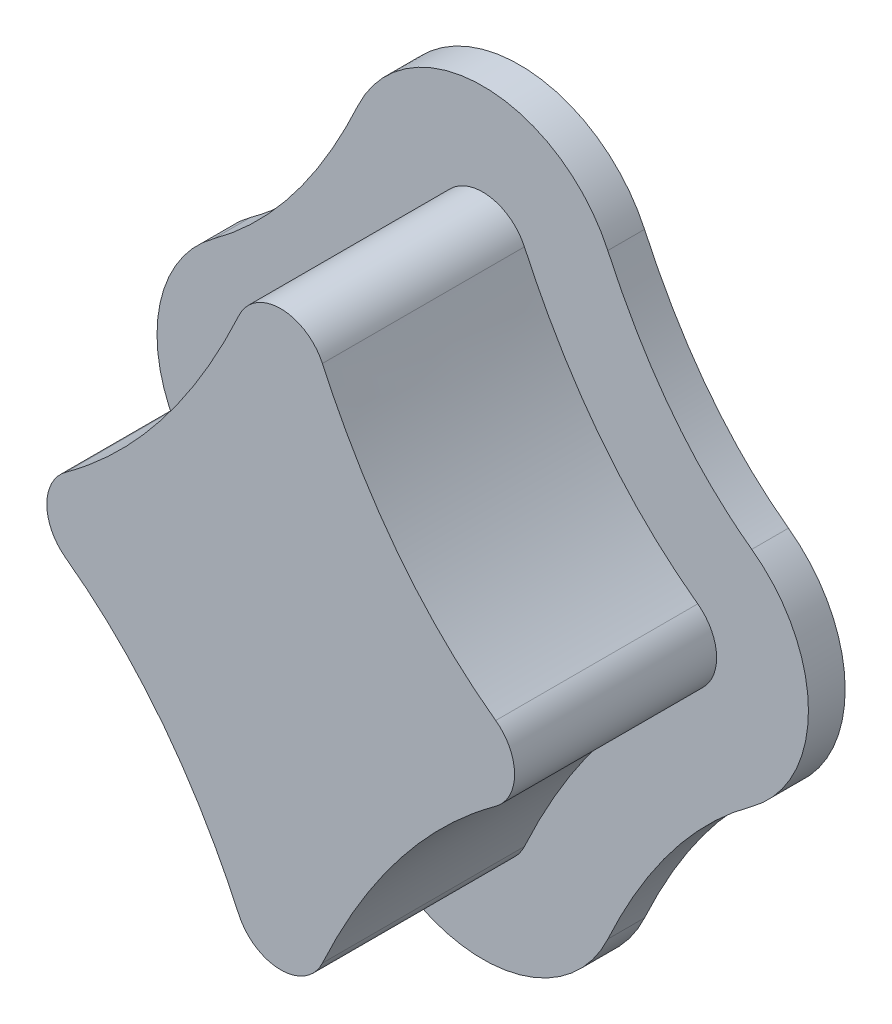
ISO-10303-21;
HEADER;
FILE_DESCRIPTION(('STEP AP214'),'2;1');
FILE_NAME('part.step','',(''),(''),'','','');
FILE_SCHEMA(('AUTOMOTIVE_DESIGN { 1 0 10303 214 1 1 1 1 }'));
ENDSEC;
DATA;
#1=APPLICATION_CONTEXT('core data for automotive mechanical design processes');
#2=APPLICATION_PROTOCOL_DEFINITION('international standard','automotive_design',2000,#1);
#3=PRODUCT_CONTEXT('',#1,'mechanical');
#4=PRODUCT('Part','Part','',(#3));
#5=PRODUCT_RELATED_PRODUCT_CATEGORY('part','',(#4));
#6=PRODUCT_DEFINITION_FORMATION('','',#4);
#7=PRODUCT_DEFINITION_CONTEXT('part definition',#1,'design');
#8=PRODUCT_DEFINITION('design','',#6,#7);
#9=PRODUCT_DEFINITION_SHAPE('','',#8);
#10=(LENGTH_UNIT() NAMED_UNIT(*) SI_UNIT(.MILLI.,.METRE.));
#11=(NAMED_UNIT(*) PLANE_ANGLE_UNIT() SI_UNIT($,.RADIAN.));
#12=(NAMED_UNIT(*) SI_UNIT($,.STERADIAN.) SOLID_ANGLE_UNIT());
#13=UNCERTAINTY_MEASURE_WITH_UNIT(LENGTH_MEASURE(1.E-05),#10,'distance_accuracy_value','');
#14=(GEOMETRIC_REPRESENTATION_CONTEXT(3) GLOBAL_UNCERTAINTY_ASSIGNED_CONTEXT((#13)) GLOBAL_UNIT_ASSIGNED_CONTEXT((#10,
#11,#12)) REPRESENTATION_CONTEXT('',''));
#15=CARTESIAN_POINT('',(0.,0.,0.));
#16=DIRECTION('',(0.,0.,1.));
#17=DIRECTION('',(1.,0.,0.));
#18=AXIS2_PLACEMENT_3D('',#15,#16,#17);
#19=CARTESIAN_POINT('',(0.,4.,2.6));
#20=CARTESIAN_POINT('',(-0.515028323958236,2.41490580617474,2.6));
#21=CARTESIAN_POINT('',(-1.36313106985769,0.834026377394227,2.6));
#22=CARTESIAN_POINT('',(-3.,0.,2.6));
#23=B_SPLINE_CURVE_WITH_KNOTS('',3,(#19,#20,#21,#22),.UNSPECIFIED.,.F.,.F.,(4,4),(0.,1.),.UNSPECIFIED.);
#24=DIRECTION('',(0.,0.,-1.));
#25=VECTOR('',#24,1.);
#26=SURFACE_OF_LINEAR_EXTRUSION('',#23,#25);
#27=DIRECTION('',(0.,0.,-1.));
#28=VECTOR('',#27,1.);
#29=CARTESIAN_POINT('',(-0.453987770861221,2.82759052216647,2.6));
#30=LINE('',#29,#28);
#31=CARTESIAN_POINT('',(-0.453987770861657,2.82759052216552,2.6));
#32=VERTEX_POINT('',#31);
#33=CARTESIAN_POINT('',(-0.453987770861221,2.82759052216647,0.4));
#34=VERTEX_POINT('',#33);
#35=EDGE_CURVE('E532',#32,#34,#30,.T.);
#36=ORIENTED_EDGE('',*,*,#35,.T.);
#37=CARTESIAN_POINT('',(0.,4.,0.4));
#38=CARTESIAN_POINT('',(-0.515028323958236,2.41490580617474,0.4));
#39=CARTESIAN_POINT('',(-1.36313106985769,0.834026377394227,0.4));
#40=CARTESIAN_POINT('',(-3.,0.,0.4));
#41=B_SPLINE_CURVE_WITH_KNOTS('',3,(#37,#38,#39,#40),.UNSPECIFIED.,.F.,.F.,(4,4),(0.,1.),.UNSPECIFIED.);
#42=CARTESIAN_POINT('',(-2.34106813028707,0.404186248686506,0.4));
#43=VERTEX_POINT('',#42);
#44=EDGE_CURVE('E183',#34,#43,#41,.T.);
#45=ORIENTED_EDGE('',*,*,#44,.T.);
#46=DIRECTION('',(0.,0.,-1.));
#47=VECTOR('',#46,1.);
#48=CARTESIAN_POINT('',(-2.34106813028707,0.404186248686506,0.));
#49=LINE('',#48,#47);
#50=CARTESIAN_POINT('',(-2.34106813028708,0.404186248686506,2.6));
#51=VERTEX_POINT('',#50);
#52=EDGE_CURVE('E530',#43,#51,#49,.F.);
#53=ORIENTED_EDGE('',*,*,#52,.T.);
#54=EDGE_CURVE('E457',#32,#51,#23,.T.);
#55=ORIENTED_EDGE('',*,*,#54,.F.);
#56=EDGE_LOOP('',(#36,#45,#53,#55));
#57=FACE_BOUND('',#56,.T.);
#58=ADVANCED_FACE('F32',(#57),#26,.F.);
#59=CARTESIAN_POINT('',(-3.,0.,2.6));
#60=CARTESIAN_POINT('',(-1.36313106985769,-0.834026377394228,2.6));
#61=CARTESIAN_POINT('',(-0.515028323958237,-2.41490580617474,2.6));
#62=CARTESIAN_POINT('',(0.,-4.,2.6));
#63=B_SPLINE_CURVE_WITH_KNOTS('',3,(#59,#60,#61,#62),.UNSPECIFIED.,.F.,.F.,(4,4),(0.,1.),.UNSPECIFIED.);
#64=DIRECTION('',(0.,0.,-1.));
#65=VECTOR('',#64,1.);
#66=SURFACE_OF_LINEAR_EXTRUSION('',#63,#65);
#67=DIRECTION('',(0.,0.,-1.));
#68=VECTOR('',#67,1.);
#69=CARTESIAN_POINT('',(-2.34106813028707,-0.404186248686511,2.6));
#70=LINE('',#69,#68);
#71=CARTESIAN_POINT('',(-2.34106813028707,-0.404186248686511,2.6));
#72=VERTEX_POINT('',#71);
#73=CARTESIAN_POINT('',(-2.34106813028707,-0.404186248686511,0.4));
#74=VERTEX_POINT('',#73);
#75=EDGE_CURVE('E501',#72,#74,#70,.T.);
#76=ORIENTED_EDGE('',*,*,#75,.T.);
#77=CARTESIAN_POINT('',(-3.,0.,0.4));
#78=CARTESIAN_POINT('',(-1.36313106985769,-0.834026377394228,0.4));
#79=CARTESIAN_POINT('',(-0.515028323958237,-2.41490580617474,0.4));
#80=CARTESIAN_POINT('',(0.,-4.,0.4));
#81=B_SPLINE_CURVE_WITH_KNOTS('',3,(#77,#78,#79,#80),.UNSPECIFIED.,.F.,.F.,(4,4),(0.,1.),.UNSPECIFIED.);
#82=CARTESIAN_POINT('',(-0.453987770861221,-2.82759052216647,0.4));
#83=VERTEX_POINT('',#82);
#84=EDGE_CURVE('E59',#74,#83,#81,.T.);
#85=ORIENTED_EDGE('',*,*,#84,.T.);
#86=DIRECTION('',(0.,0.,-1.));
#87=VECTOR('',#86,1.);
#88=CARTESIAN_POINT('',(-0.453987770861221,-2.82759052216647,0.));
#89=LINE('',#88,#87);
#90=CARTESIAN_POINT('',(-0.453987770861658,-2.82759052216552,2.6));
#91=VERTEX_POINT('',#90);
#92=EDGE_CURVE('E557',#83,#91,#89,.F.);
#93=ORIENTED_EDGE('',*,*,#92,.T.);
#94=EDGE_CURVE('E463',#72,#91,#63,.T.);
#95=ORIENTED_EDGE('',*,*,#94,.F.);
#96=EDGE_LOOP('',(#76,#85,#93,#95));
#97=FACE_BOUND('',#96,.T.);
#98=ADVANCED_FACE('F443',(#97),#66,.F.);
#99=CARTESIAN_POINT('',(0.,-4.,2.6));
#100=CARTESIAN_POINT('',(0.515028323958236,-2.41490580617474,2.6));
#101=CARTESIAN_POINT('',(1.36313106985769,-0.834026377394228,2.6));
#102=CARTESIAN_POINT('',(3.,0.,2.6));
#103=B_SPLINE_CURVE_WITH_KNOTS('',3,(#99,#100,#101,#102),.UNSPECIFIED.,.F.,.F.,(4,4),(0.,1.),.UNSPECIFIED.);
#104=DIRECTION('',(0.,0.,-1.));
#105=VECTOR('',#104,1.);
#106=SURFACE_OF_LINEAR_EXTRUSION('',#103,#105);
#107=DIRECTION('',(0.,0.,-1.));
#108=VECTOR('',#107,1.);
#109=CARTESIAN_POINT('',(0.453987770861221,-2.82759052216647,2.6));
#110=LINE('',#109,#108);
#111=CARTESIAN_POINT('',(0.453987770861657,-2.82759052216552,2.6));
#112=VERTEX_POINT('',#111);
#113=CARTESIAN_POINT('',(0.453987770861221,-2.82759052216647,0.4));
#114=VERTEX_POINT('',#113);
#115=EDGE_CURVE('E496',#112,#114,#110,.T.);
#116=ORIENTED_EDGE('',*,*,#115,.T.);
#117=CARTESIAN_POINT('',(0.,-4.,0.4));
#118=CARTESIAN_POINT('',(0.515028323958236,-2.41490580617474,0.4));
#119=CARTESIAN_POINT('',(1.36313106985769,-0.834026377394228,0.4));
#120=CARTESIAN_POINT('',(3.,0.,0.4));
#121=B_SPLINE_CURVE_WITH_KNOTS('',3,(#117,#118,#119,#120),.UNSPECIFIED.,.F.,.F.,(4,4),(0.,1.),.UNSPECIFIED.);
#122=CARTESIAN_POINT('',(2.34106813028708,-0.404186248686507,0.4));
#123=VERTEX_POINT('',#122);
#124=EDGE_CURVE('E498',#114,#123,#121,.T.);
#125=ORIENTED_EDGE('',*,*,#124,.T.);
#126=DIRECTION('',(0.,0.,-1.));
#127=VECTOR('',#126,1.);
#128=CARTESIAN_POINT('',(2.34106813028708,-0.404186248686507,0.));
#129=LINE('',#128,#127);
#130=CARTESIAN_POINT('',(2.34106813028708,-0.404186248686507,2.6));
#131=VERTEX_POINT('',#130);
#132=EDGE_CURVE('E502',#123,#131,#129,.F.);
#133=ORIENTED_EDGE('',*,*,#132,.T.);
#134=EDGE_CURVE('E473',#112,#131,#103,.T.);
#135=ORIENTED_EDGE('',*,*,#134,.F.);
#136=EDGE_LOOP('',(#116,#125,#133,#135));
#137=FACE_BOUND('',#136,.T.);
#138=ADVANCED_FACE('F449',(#137),#106,.F.);
#139=CARTESIAN_POINT('',(3.,0.,2.6));
#140=CARTESIAN_POINT('',(1.36313106985769,0.834026377394227,2.6));
#141=CARTESIAN_POINT('',(0.515028323958237,2.41490580617474,2.6));
#142=CARTESIAN_POINT('',(0.,4.,2.6));
#143=B_SPLINE_CURVE_WITH_KNOTS('',3,(#139,#140,#141,#142),.UNSPECIFIED.,.F.,.F.,(4,4),(0.,1.),.UNSPECIFIED.);
#144=DIRECTION('',(0.,0.,-1.));
#145=VECTOR('',#144,1.);
#146=SURFACE_OF_LINEAR_EXTRUSION('',#143,#145);
#147=DIRECTION('',(0.,0.,-1.));
#148=VECTOR('',#147,1.);
#149=CARTESIAN_POINT('',(2.34106813028707,0.40418624868651,2.6));
#150=LINE('',#149,#148);
#151=CARTESIAN_POINT('',(2.34106813028707,0.40418624868651,2.6));
#152=VERTEX_POINT('',#151);
#153=CARTESIAN_POINT('',(2.34106813028707,0.40418624868651,0.4));
#154=VERTEX_POINT('',#153);
#155=EDGE_CURVE('E43',#152,#154,#150,.T.);
#156=ORIENTED_EDGE('',*,*,#155,.T.);
#157=CARTESIAN_POINT('',(3.,0.,0.4));
#158=CARTESIAN_POINT('',(1.36313106985769,0.834026377394227,0.4));
#159=CARTESIAN_POINT('',(0.515028323958237,2.41490580617474,0.4));
#160=CARTESIAN_POINT('',(0.,4.,0.4));
#161=B_SPLINE_CURVE_WITH_KNOTS('',3,(#157,#158,#159,#160),.UNSPECIFIED.,.F.,.F.,(4,4),(0.,1.),.UNSPECIFIED.);
#162=CARTESIAN_POINT('',(0.453987770861657,2.82759052216553,0.4));
#163=VERTEX_POINT('',#162);
#164=EDGE_CURVE('E180',#154,#163,#161,.T.);
#165=ORIENTED_EDGE('',*,*,#164,.T.);
#166=DIRECTION('',(0.,0.,-1.));
#167=VECTOR('',#166,1.);
#168=CARTESIAN_POINT('',(0.453987770861221,2.82759052216647,0.));
#169=LINE('',#168,#167);
#170=CARTESIAN_POINT('',(0.453987770861657,2.82759052216553,2.6));
#171=VERTEX_POINT('',#170);
#172=EDGE_CURVE('E538',#163,#171,#169,.F.);
#173=ORIENTED_EDGE('',*,*,#172,.T.);
#174=EDGE_CURVE('E481',#152,#171,#143,.T.);
#175=ORIENTED_EDGE('',*,*,#174,.F.);
#176=EDGE_LOOP('',(#156,#165,#173,#175));
#177=FACE_BOUND('',#176,.T.);
#178=ADVANCED_FACE('F396',(#177),#146,.F.);
#179=CARTESIAN_POINT('',(-1.07930977268097,1.71834956883836,2.6));
#180=DIRECTION('',(0.,0.,1.));
#181=DIRECTION('',(1.,0.,0.));
#182=AXIS2_PLACEMENT_3D('',#179,#180,#181);
#183=PLANE('',#182);
#184=ORIENTED_EDGE('',*,*,#94,.T.);
#185=CARTESIAN_POINT('',(0.,-2.61807893797968,2.6));
#186=DIRECTION('',(0.,0.,1.));
#187=DIRECTION('',(1.,0.,0.));
#188=AXIS2_PLACEMENT_3D('',#185,#186,#187);
#189=CIRCLE('',#188,0.5);
#190=EDGE_CURVE('E541',#91,#112,#189,.T.);
#191=ORIENTED_EDGE('',*,*,#190,.T.);
#192=ORIENTED_EDGE('',*,*,#134,.T.);
#193=CARTESIAN_POINT('',(2.0467324777189,0.,2.6));
#194=DIRECTION('',(0.,0.,1.));
#195=DIRECTION('',(1.,0.,0.));
#196=AXIS2_PLACEMENT_3D('',#193,#194,#195);
#197=CIRCLE('',#196,0.5);
#198=EDGE_CURVE('E554',#131,#152,#197,.T.);
#199=ORIENTED_EDGE('',*,*,#198,.T.);
#200=ORIENTED_EDGE('',*,*,#174,.T.);
#201=CARTESIAN_POINT('',(0.,2.61807893797968,2.6));
#202=DIRECTION('',(0.,0.,1.));
#203=DIRECTION('',(1.,0.,0.));
#204=AXIS2_PLACEMENT_3D('',#201,#202,#203);
#205=CIRCLE('',#204,0.5);
#206=EDGE_CURVE('E552',#171,#32,#205,.T.);
#207=ORIENTED_EDGE('',*,*,#206,.T.);
#208=ORIENTED_EDGE('',*,*,#54,.T.);
#209=CARTESIAN_POINT('',(-2.0467324777189,0.,2.6));
#210=DIRECTION('',(0.,0.,1.));
#211=DIRECTION('',(1.,0.,0.));
#212=AXIS2_PLACEMENT_3D('',#209,#210,#211);
#213=CIRCLE('',#212,0.5);
#214=EDGE_CURVE('E537',#51,#72,#213,.T.);
#215=ORIENTED_EDGE('',*,*,#214,.T.);
#216=EDGE_LOOP('',(#184,#191,#192,#199,#200,#207,#208,#215));
#217=FACE_BOUND('',#216,.T.);
#218=ADVANCED_FACE('F210',(#217),#183,.T.);
#219=CARTESIAN_POINT('',(0.,-2.61807893797968,1.3));
#220=DIRECTION('',(0.,0.,-1.));
#221=DIRECTION('',(-1.,0.,0.));
#222=AXIS2_PLACEMENT_3D('',#219,#220,#221);
#223=CYLINDRICAL_SURFACE('',#222,0.5);
#224=CARTESIAN_POINT('',(0.,-2.61807893797968,0.4));
#225=DIRECTION('',(0.,0.,1.));
#226=DIRECTION('',(1.,0.,0.));
#227=AXIS2_PLACEMENT_3D('',#224,#225,#226);
#228=CIRCLE('',#227,0.5);
#229=EDGE_CURVE('E51',#114,#83,#228,.F.);
#230=ORIENTED_EDGE('',*,*,#229,.F.);
#231=ORIENTED_EDGE('',*,*,#115,.F.);
#232=ORIENTED_EDGE('',*,*,#190,.F.);
#233=ORIENTED_EDGE('',*,*,#92,.F.);
#234=EDGE_LOOP('',(#230,#231,#232,#233));
#235=FACE_BOUND('',#234,.T.);
#236=ADVANCED_FACE('F455',(#235),#223,.T.);
#237=CARTESIAN_POINT('',(-2.0467324777189,0.,1.3));
#238=DIRECTION('',(0.,0.,-1.));
#239=DIRECTION('',(-1.,0.,0.));
#240=AXIS2_PLACEMENT_3D('',#237,#238,#239);
#241=CYLINDRICAL_SURFACE('',#240,0.5);
#242=CARTESIAN_POINT('',(-2.0467324777189,0.,0.4));
#243=DIRECTION('',(0.,0.,1.));
#244=DIRECTION('',(1.,0.,0.));
#245=AXIS2_PLACEMENT_3D('',#242,#243,#244);
#246=CIRCLE('',#245,0.5);
#247=EDGE_CURVE('E507',#74,#43,#246,.F.);
#248=ORIENTED_EDGE('',*,*,#247,.F.);
#249=ORIENTED_EDGE('',*,*,#75,.F.);
#250=ORIENTED_EDGE('',*,*,#214,.F.);
#251=ORIENTED_EDGE('',*,*,#52,.F.);
#252=EDGE_LOOP('',(#248,#249,#250,#251));
#253=FACE_BOUND('',#252,.T.);
#254=ADVANCED_FACE('F535',(#253),#241,.T.);
#255=CARTESIAN_POINT('',(2.0467324777189,0.,1.3));
#256=DIRECTION('',(0.,0.,-1.));
#257=DIRECTION('',(-1.,0.,0.));
#258=AXIS2_PLACEMENT_3D('',#255,#256,#257);
#259=CYLINDRICAL_SURFACE('',#258,0.5);
#260=CARTESIAN_POINT('',(2.0467324777189,0.,0.4));
#261=DIRECTION('',(0.,0.,1.));
#262=DIRECTION('',(1.,0.,0.));
#263=AXIS2_PLACEMENT_3D('',#260,#261,#262);
#264=CIRCLE('',#263,0.5);
#265=EDGE_CURVE('E506',#154,#123,#264,.F.);
#266=ORIENTED_EDGE('',*,*,#265,.F.);
#267=ORIENTED_EDGE('',*,*,#155,.F.);
#268=ORIENTED_EDGE('',*,*,#198,.F.);
#269=ORIENTED_EDGE('',*,*,#132,.F.);
#270=EDGE_LOOP('',(#266,#267,#268,#269));
#271=FACE_BOUND('',#270,.T.);
#272=ADVANCED_FACE('F567',(#271),#259,.T.);
#273=CARTESIAN_POINT('',(0.,2.61807893797968,1.3));
#274=DIRECTION('',(0.,0.,-1.));
#275=DIRECTION('',(-1.,0.,0.));
#276=AXIS2_PLACEMENT_3D('',#273,#274,#275);
#277=CYLINDRICAL_SURFACE('',#276,0.5);
#278=CARTESIAN_POINT('',(0.,2.61807893797968,0.4));
#279=DIRECTION('',(0.,0.,1.));
#280=DIRECTION('',(1.,0.,0.));
#281=AXIS2_PLACEMENT_3D('',#278,#279,#280);
#282=CIRCLE('',#281,0.5);
#283=EDGE_CURVE('E11',#34,#163,#282,.F.);
#284=ORIENTED_EDGE('',*,*,#283,.F.);
#285=ORIENTED_EDGE('',*,*,#35,.F.);
#286=ORIENTED_EDGE('',*,*,#206,.F.);
#287=ORIENTED_EDGE('',*,*,#172,.F.);
#288=EDGE_LOOP('',(#284,#285,#286,#287));
#289=FACE_BOUND('',#288,.T.);
#290=ADVANCED_FACE('F34',(#289),#277,.T.);
#291=CARTESIAN_POINT('',(-1.36196331258444,3.24661369053838,0.4));
#292=CARTESIAN_POINT('',(-1.54359804863867,2.85303187857204,0.4));
#293=CARTESIAN_POINT('',(-1.75763553928025,2.47411694981708,0.4));
#294=CARTESIAN_POINT('',(-2.27478193280841,1.78099121797967,0.4));
#295=CARTESIAN_POINT('',(-2.57878831480917,1.46812762659717,0.4));
#296=CARTESIAN_POINT('',(-2.92973943542342,1.21255874605952,0.4));
#297=B_SPLINE_CURVE_WITH_KNOTS('',3,(#291,#292,#293,#294,#295,#296),.UNSPECIFIED.,.F.,.F.,(4,2,
4),(0.,0.5,1.),.UNSPECIFIED.);
#298=DIRECTION('',(0.,0.,-1.));
#299=VECTOR('',#298,1.);
#300=SURFACE_OF_LINEAR_EXTRUSION('',#297,#299);
#301=CARTESIAN_POINT('',(-1.36196331258444,3.24661369053838,0.));
#302=CARTESIAN_POINT('',(-1.54359804863867,2.85303187857204,0.));
#303=CARTESIAN_POINT('',(-1.75763553928025,2.47411694981708,0.));
#304=CARTESIAN_POINT('',(-2.27478193280841,1.78099121797967,0.));
#305=CARTESIAN_POINT('',(-2.57878831480917,1.46812762659717,0.));
#306=CARTESIAN_POINT('',(-2.92973943542342,1.21255874605952,0.));
#307=B_SPLINE_CURVE_WITH_KNOTS('',3,(#301,#302,#303,#304,#305,#306),.UNSPECIFIED.,.F.,.F.,(4,2,
4),(0.,0.5,1.),.UNSPECIFIED.);
#308=CARTESIAN_POINT('',(-1.36196331258444,3.24661369053838,0.));
#309=VERTEX_POINT('',#308);
#310=CARTESIAN_POINT('',(-2.92973943542341,1.21255874605951,0.));
#311=VERTEX_POINT('',#310);
#312=EDGE_CURVE('E178',#309,#311,#307,.T.);
#313=ORIENTED_EDGE('',*,*,#312,.T.);
#314=DIRECTION('',(0.,0.,-1.));
#315=VECTOR('',#314,1.);
#316=CARTESIAN_POINT('',(-2.92973943542341,1.21255874605951,0.4));
#317=LINE('',#316,#315);
#318=CARTESIAN_POINT('',(-2.92973943542341,1.21255874605951,0.4));
#319=VERTEX_POINT('',#318);
#320=EDGE_CURVE('E155',#319,#311,#317,.T.);
#321=ORIENTED_EDGE('',*,*,#320,.F.);
#322=CARTESIAN_POINT('',(-2.92973943542342,1.21255874605952,0.4));
#323=CARTESIAN_POINT('',(-2.57878831480917,1.46812762659717,0.4));
#324=CARTESIAN_POINT('',(-2.27478193280841,1.78099121797967,0.4));
#325=CARTESIAN_POINT('',(-1.75763553928025,2.47411694981708,0.4));
#326=CARTESIAN_POINT('',(-1.54359804863867,2.85303187857204,0.4));
#327=CARTESIAN_POINT('',(-1.36196331258444,3.24661369053838,0.4));
#328=B_SPLINE_CURVE_WITH_KNOTS('',3,(#322,#323,#324,#325,#326,#327),.UNSPECIFIED.,.F.,.F.,(4,2,
4),(0.,0.5,1.),.UNSPECIFIED.);
#329=CARTESIAN_POINT('',(-1.36196331258444,3.24661369053838,0.4));
#330=VERTEX_POINT('',#329);
#331=EDGE_CURVE('E162',#330,#319,#328,.F.);
#332=ORIENTED_EDGE('',*,*,#331,.F.);
#333=DIRECTION('',(0.,0.,-1.));
#334=VECTOR('',#333,1.);
#335=CARTESIAN_POINT('',(-1.36196331258444,3.24661369053838,0.4));
#336=LINE('',#335,#334);
#337=EDGE_CURVE('E360',#330,#309,#336,.T.);
#338=ORIENTED_EDGE('',*,*,#337,.T.);
#339=EDGE_LOOP('',(#313,#321,#332,#338));
#340=FACE_BOUND('',#339,.T.);
#341=ADVANCED_FACE('F176',(#340),#300,.F.);
#342=CARTESIAN_POINT('',(-2.0467324777189,0.,0.4));
#343=DIRECTION('',(0.,0.,-1.));
#344=DIRECTION('',(-1.,0.,0.));
#345=AXIS2_PLACEMENT_3D('',#342,#343,#344);
#346=CYLINDRICAL_SURFACE('',#345,1.50000000000001);
#347=CARTESIAN_POINT('',(-2.0467324777189,0.,0.));
#348=DIRECTION('',(0.,0.,1.));
#349=DIRECTION('',(1.,0.,0.));
#350=AXIS2_PLACEMENT_3D('',#347,#348,#349);
#351=CIRCLE('',#350,1.50000000000001);
#352=CARTESIAN_POINT('',(-2.92973943542341,-1.21255874605953,0.));
#353=VERTEX_POINT('',#352);
#354=EDGE_CURVE('E249',#311,#353,#351,.T.);
#355=ORIENTED_EDGE('',*,*,#354,.T.);
#356=DIRECTION('',(0.,0.,-1.));
#357=VECTOR('',#356,1.);
#358=CARTESIAN_POINT('',(-2.92973943542341,-1.21255874605953,0.4));
#359=LINE('',#358,#357);
#360=CARTESIAN_POINT('',(-2.92973943542341,-1.21255874605953,0.4));
#361=VERTEX_POINT('',#360);
#362=EDGE_CURVE('E158',#361,#353,#359,.T.);
#363=ORIENTED_EDGE('',*,*,#362,.F.);
#364=CARTESIAN_POINT('',(-2.0467324777189,0.,0.4));
#365=DIRECTION('',(0.,0.,1.));
#366=DIRECTION('',(1.,0.,0.));
#367=AXIS2_PLACEMENT_3D('',#364,#365,#366);
#368=CIRCLE('',#367,1.50000000000001);
#369=EDGE_CURVE('E151',#319,#361,#368,.T.);
#370=ORIENTED_EDGE('',*,*,#369,.F.);
#371=ORIENTED_EDGE('',*,*,#320,.T.);
#372=EDGE_LOOP('',(#355,#363,#370,#371));
#373=FACE_BOUND('',#372,.T.);
#374=ADVANCED_FACE('F153',(#373),#346,.T.);
#375=CARTESIAN_POINT('',(-2.92973943542341,-1.21255874605953,0.4));
#376=CARTESIAN_POINT('',(-2.75421317517762,-1.34038010693014,0.4));
#377=CARTESIAN_POINT('',(-2.5910673558433,-1.48161194706402,0.4));
#378=CARTESIAN_POINT('',(-2.2869793770807,-1.78812660603829,0.4));
#379=CARTESIAN_POINT('',(-2.14580641013834,-1.95388739671825,0.4));
#380=CARTESIAN_POINT('',(-1.75780894244397,-2.47382128235862,0.4));
#381=CARTESIAN_POINT('',(-1.54364392888023,-2.85293246130748,0.4));
#382=CARTESIAN_POINT('',(-1.36196331258444,-3.24661369053838,0.4));
#383=B_SPLINE_CURVE_WITH_KNOTS('',3,(#375,#376,#377,#378,#379,#380,#381,#382),.UNSPECIFIED.,.F.,
.F.,(4,2,2,4),(0.,0.25,0.5,1.),.UNSPECIFIED.);
#384=DIRECTION('',(0.,0.,-1.));
#385=VECTOR('',#384,1.);
#386=SURFACE_OF_LINEAR_EXTRUSION('',#383,#385);
#387=CARTESIAN_POINT('',(-2.92973943542341,-1.21255874605953,0.));
#388=CARTESIAN_POINT('',(-2.75421317517762,-1.34038010693014,0.));
#389=CARTESIAN_POINT('',(-2.5910673558433,-1.48161194706402,0.));
#390=CARTESIAN_POINT('',(-2.2869793770807,-1.78812660603829,0.));
#391=CARTESIAN_POINT('',(-2.14580641013834,-1.95388739671825,0.));
#392=CARTESIAN_POINT('',(-1.75780894244397,-2.47382128235862,0.));
#393=CARTESIAN_POINT('',(-1.54364392888023,-2.85293246130748,0.));
#394=CARTESIAN_POINT('',(-1.36196331258444,-3.24661369053838,0.));
#395=B_SPLINE_CURVE_WITH_KNOTS('',3,(#387,#388,#389,#390,#391,#392,#393,#394),.UNSPECIFIED.,.F.,
.F.,(4,2,2,4),(0.,0.25,0.5,1.),.UNSPECIFIED.);
#396=CARTESIAN_POINT('',(-1.36196331258444,-3.24661369053838,0.));
#397=VERTEX_POINT('',#396);
#398=EDGE_CURVE('E255',#353,#397,#395,.T.);
#399=ORIENTED_EDGE('',*,*,#398,.T.);
#400=DIRECTION('',(0.,0.,-1.));
#401=VECTOR('',#400,1.);
#402=CARTESIAN_POINT('',(-1.36196331258444,-3.24661369053838,0.4));
#403=LINE('',#402,#401);
#404=CARTESIAN_POINT('',(-1.36196331258444,-3.24661369053838,0.4));
#405=VERTEX_POINT('',#404);
#406=EDGE_CURVE('E185',#405,#397,#403,.T.);
#407=ORIENTED_EDGE('',*,*,#406,.F.);
#408=CARTESIAN_POINT('',(-1.36196331258444,-3.24661369053838,0.4));
#409=CARTESIAN_POINT('',(-1.54364392888023,-2.85293246130748,0.4));
#410=CARTESIAN_POINT('',(-1.75780894244397,-2.47382128235862,0.4));
#411=CARTESIAN_POINT('',(-2.14580641013834,-1.95388739671825,0.4));
#412=CARTESIAN_POINT('',(-2.2869793770807,-1.78812660603829,0.4));
#413=CARTESIAN_POINT('',(-2.5910673558433,-1.48161194706402,0.4));
#414=CARTESIAN_POINT('',(-2.75421317517762,-1.34038010693014,0.4));
#415=CARTESIAN_POINT('',(-2.92973943542341,-1.21255874605953,0.4));
#416=B_SPLINE_CURVE_WITH_KNOTS('',3,(#408,#409,#410,#411,#412,#413,#414,#415),.UNSPECIFIED.,.F.,
.F.,(4,2,2,4),(0.,0.5,0.75,1.),.UNSPECIFIED.);
#417=EDGE_CURVE('E161',#361,#405,#416,.F.);
#418=ORIENTED_EDGE('',*,*,#417,.F.);
#419=ORIENTED_EDGE('',*,*,#362,.T.);
#420=EDGE_LOOP('',(#399,#407,#418,#419));
#421=FACE_BOUND('',#420,.T.);
#422=ADVANCED_FACE('F231',(#421),#386,.F.);
#423=CARTESIAN_POINT('',(0.,-2.61807893797968,0.4));
#424=DIRECTION('',(0.,0.,-1.));
#425=DIRECTION('',(-1.,0.,0.));
#426=AXIS2_PLACEMENT_3D('',#423,#424,#425);
#427=CYLINDRICAL_SURFACE('',#426,1.5);
#428=CARTESIAN_POINT('',(0.,-2.61807893797968,0.));
#429=DIRECTION('',(0.,0.,1.));
#430=DIRECTION('',(1.,0.,0.));
#431=AXIS2_PLACEMENT_3D('',#428,#429,#430);
#432=CIRCLE('',#431,1.5);
#433=CARTESIAN_POINT('',(1.36196331258497,-3.24661369053722,0.));
#434=VERTEX_POINT('',#433);
#435=EDGE_CURVE('E257',#397,#434,#432,.T.);
#436=ORIENTED_EDGE('',*,*,#435,.T.);
#437=DIRECTION('',(0.,0.,-1.));
#438=VECTOR('',#437,1.);
#439=CARTESIAN_POINT('',(1.36196331258497,-3.24661369053722,0.4));
#440=LINE('',#439,#438);
#441=CARTESIAN_POINT('',(1.36196331258497,-3.24661369053722,0.4));
#442=VERTEX_POINT('',#441);
#443=EDGE_CURVE('E417',#442,#434,#440,.T.);
#444=ORIENTED_EDGE('',*,*,#443,.F.);
#445=CARTESIAN_POINT('',(0.,-2.61807893797968,0.4));
#446=DIRECTION('',(0.,0.,1.));
#447=DIRECTION('',(1.,0.,0.));
#448=AXIS2_PLACEMENT_3D('',#445,#446,#447);
#449=CIRCLE('',#448,1.5);
#450=EDGE_CURVE('E318',#405,#442,#449,.T.);
#451=ORIENTED_EDGE('',*,*,#450,.F.);
#452=ORIENTED_EDGE('',*,*,#406,.T.);
#453=EDGE_LOOP('',(#436,#444,#451,#452));
#454=FACE_BOUND('',#453,.T.);
#455=ADVANCED_FACE('F235',(#454),#427,.T.);
#456=CARTESIAN_POINT('',(1.36196331258497,-3.24661369053722,0.4));
#457=CARTESIAN_POINT('',(1.54359804863912,-2.85303187857107,0.4));
#458=CARTESIAN_POINT('',(1.75763553928071,-2.47411694981637,0.4));
#459=CARTESIAN_POINT('',(2.27478193280871,-1.78099121797936,0.4));
#460=CARTESIAN_POINT('',(2.57878831480934,-1.46812762659705,0.4));
#461=CARTESIAN_POINT('',(2.92973943542342,-1.21255874605952,0.4));
#462=B_SPLINE_CURVE_WITH_KNOTS('',3,(#456,#457,#458,#459,#460,#461),.UNSPECIFIED.,.F.,.F.,(4,2,
4),(0.,0.5,1.),.UNSPECIFIED.);
#463=DIRECTION('',(0.,0.,-1.));
#464=VECTOR('',#463,1.);
#465=SURFACE_OF_LINEAR_EXTRUSION('',#462,#464);
#466=CARTESIAN_POINT('',(1.36196331258497,-3.24661369053722,0.));
#467=CARTESIAN_POINT('',(1.54359804863912,-2.85303187857107,0.));
#468=CARTESIAN_POINT('',(1.75763553928071,-2.47411694981637,0.));
#469=CARTESIAN_POINT('',(2.27478193280871,-1.78099121797936,0.));
#470=CARTESIAN_POINT('',(2.57878831480934,-1.46812762659705,0.));
#471=CARTESIAN_POINT('',(2.92973943542342,-1.21255874605952,0.));
#472=B_SPLINE_CURVE_WITH_KNOTS('',3,(#466,#467,#468,#469,#470,#471),.UNSPECIFIED.,.F.,.F.,(4,2,
4),(0.,0.5,1.),.UNSPECIFIED.);
#473=CARTESIAN_POINT('',(2.92973943542342,-1.21255874605952,0.));
#474=VERTEX_POINT('',#473);
#475=EDGE_CURVE('E261',#434,#474,#472,.T.);
#476=ORIENTED_EDGE('',*,*,#475,.T.);
#477=DIRECTION('',(0.,0.,-1.));
#478=VECTOR('',#477,1.);
#479=CARTESIAN_POINT('',(2.92973943542342,-1.21255874605952,0.4));
#480=LINE('',#479,#478);
#481=CARTESIAN_POINT('',(2.92973943542342,-1.21255874605952,0.4));
#482=VERTEX_POINT('',#481);
#483=EDGE_CURVE('E416',#482,#474,#480,.T.);
#484=ORIENTED_EDGE('',*,*,#483,.F.);
#485=CARTESIAN_POINT('',(2.92973943542342,-1.21255874605952,0.4));
#486=CARTESIAN_POINT('',(2.57878831480934,-1.46812762659705,0.4));
#487=CARTESIAN_POINT('',(2.27478193280871,-1.78099121797936,0.4));
#488=CARTESIAN_POINT('',(1.75763553928071,-2.47411694981637,0.4));
#489=CARTESIAN_POINT('',(1.54359804863912,-2.85303187857107,0.4));
#490=CARTESIAN_POINT('',(1.36196331258497,-3.24661369053722,0.4));
#491=B_SPLINE_CURVE_WITH_KNOTS('',3,(#485,#486,#487,#488,#489,#490),.UNSPECIFIED.,.F.,.F.,(4,2,
4),(0.,0.5,1.),.UNSPECIFIED.);
#492=EDGE_CURVE('E314',#442,#482,#491,.F.);
#493=ORIENTED_EDGE('',*,*,#492,.F.);
#494=ORIENTED_EDGE('',*,*,#443,.T.);
#495=EDGE_LOOP('',(#476,#484,#493,#494));
#496=FACE_BOUND('',#495,.T.);
#497=ADVANCED_FACE('F320',(#496),#465,.F.);
#498=CARTESIAN_POINT('',(2.0467324777189,0.,0.4));
#499=DIRECTION('',(0.,0.,-1.));
#500=DIRECTION('',(-1.,0.,0.));
#501=AXIS2_PLACEMENT_3D('',#498,#499,#500);
#502=CYLINDRICAL_SURFACE('',#501,1.50000000000001);
#503=CARTESIAN_POINT('',(2.0467324777189,0.,0.));
#504=DIRECTION('',(0.,0.,1.));
#505=DIRECTION('',(1.,0.,0.));
#506=AXIS2_PLACEMENT_3D('',#503,#504,#505);
#507=CIRCLE('',#506,1.50000000000001);
#508=CARTESIAN_POINT('',(2.92973943542342,1.21255874605952,0.));
#509=VERTEX_POINT('',#508);
#510=EDGE_CURVE('E267',#474,#509,#507,.T.);
#511=ORIENTED_EDGE('',*,*,#510,.T.);
#512=DIRECTION('',(0.,0.,-1.));
#513=VECTOR('',#512,1.);
#514=CARTESIAN_POINT('',(2.92973943542342,1.21255874605952,0.4));
#515=LINE('',#514,#513);
#516=CARTESIAN_POINT('',(2.92973943542342,1.21255874605952,0.4));
#517=VERTEX_POINT('',#516);
#518=EDGE_CURVE('E359',#517,#509,#515,.T.);
#519=ORIENTED_EDGE('',*,*,#518,.F.);
#520=CARTESIAN_POINT('',(2.0467324777189,0.,0.4));
#521=DIRECTION('',(0.,0.,1.));
#522=DIRECTION('',(1.,0.,0.));
#523=AXIS2_PLACEMENT_3D('',#520,#521,#522);
#524=CIRCLE('',#523,1.50000000000001);
#525=EDGE_CURVE('E349',#482,#517,#524,.T.);
#526=ORIENTED_EDGE('',*,*,#525,.F.);
#527=ORIENTED_EDGE('',*,*,#483,.T.);
#528=EDGE_LOOP('',(#511,#519,#526,#527));
#529=FACE_BOUND('',#528,.T.);
#530=ADVANCED_FACE('F329',(#529),#502,.T.);
#531=CARTESIAN_POINT('',(2.92973943542342,1.21255874605952,0.4));
#532=CARTESIAN_POINT('',(2.75421317517762,1.34038010693013,0.4));
#533=CARTESIAN_POINT('',(2.5910673558433,1.48161194706402,0.4));
#534=CARTESIAN_POINT('',(2.2869793770807,1.78812660603829,0.4));
#535=CARTESIAN_POINT('',(2.14580641013834,1.95388739671825,0.4));
#536=CARTESIAN_POINT('',(1.75780894244397,2.47382128235862,0.4));
#537=CARTESIAN_POINT('',(1.54364392888023,2.85293246130748,0.4));
#538=CARTESIAN_POINT('',(1.36196331258444,3.24661369053838,0.4));
#539=B_SPLINE_CURVE_WITH_KNOTS('',3,(#531,#532,#533,#534,#535,#536,#537,#538),.UNSPECIFIED.,.F.,
.F.,(4,2,2,4),(0.,0.25,0.5,1.),.UNSPECIFIED.);
#540=DIRECTION('',(0.,0.,-1.));
#541=VECTOR('',#540,1.);
#542=SURFACE_OF_LINEAR_EXTRUSION('',#539,#541);
#543=CARTESIAN_POINT('',(2.92973943542342,1.21255874605952,0.));
#544=CARTESIAN_POINT('',(2.75421317517762,1.34038010693013,0.));
#545=CARTESIAN_POINT('',(2.5910673558433,1.48161194706402,0.));
#546=CARTESIAN_POINT('',(2.2869793770807,1.78812660603829,0.));
#547=CARTESIAN_POINT('',(2.14580641013834,1.95388739671825,0.));
#548=CARTESIAN_POINT('',(1.75780894244397,2.47382128235862,0.));
#549=CARTESIAN_POINT('',(1.54364392888023,2.85293246130748,0.));
#550=CARTESIAN_POINT('',(1.36196331258444,3.24661369053838,0.));
#551=B_SPLINE_CURVE_WITH_KNOTS('',3,(#543,#544,#545,#546,#547,#548,#549,#550),.UNSPECIFIED.,.F.,
.F.,(4,2,2,4),(0.,0.25,0.5,1.),.UNSPECIFIED.);
#552=CARTESIAN_POINT('',(1.36196331258444,3.24661369053838,0.));
#553=VERTEX_POINT('',#552);
#554=EDGE_CURVE('E355',#509,#553,#551,.T.);
#555=ORIENTED_EDGE('',*,*,#554,.T.);
#556=DIRECTION('',(0.,0.,-1.));
#557=VECTOR('',#556,1.);
#558=CARTESIAN_POINT('',(1.36196331258444,3.24661369053838,0.4));
#559=LINE('',#558,#557);
#560=CARTESIAN_POINT('',(1.36196331258444,3.24661369053838,0.4));
#561=VERTEX_POINT('',#560);
#562=EDGE_CURVE('E353',#561,#553,#559,.T.);
#563=ORIENTED_EDGE('',*,*,#562,.F.);
#564=CARTESIAN_POINT('',(1.36196331258444,3.24661369053838,0.4));
#565=CARTESIAN_POINT('',(1.54364392888023,2.85293246130748,0.4));
#566=CARTESIAN_POINT('',(1.75780894244397,2.47382128235862,0.4));
#567=CARTESIAN_POINT('',(2.14580641013834,1.95388739671825,0.4));
#568=CARTESIAN_POINT('',(2.2869793770807,1.78812660603829,0.4));
#569=CARTESIAN_POINT('',(2.5910673558433,1.48161194706402,0.4));
#570=CARTESIAN_POINT('',(2.75421317517762,1.34038010693013,0.4));
#571=CARTESIAN_POINT('',(2.92973943542342,1.21255874605952,0.4));
#572=B_SPLINE_CURVE_WITH_KNOTS('',3,(#564,#565,#566,#567,#568,#569,#570,#571),.UNSPECIFIED.,.F.,
.F.,(4,2,2,4),(0.,0.5,0.75,1.),.UNSPECIFIED.);
#573=EDGE_CURVE('E346',#517,#561,#572,.F.);
#574=ORIENTED_EDGE('',*,*,#573,.F.);
#575=ORIENTED_EDGE('',*,*,#518,.T.);
#576=EDGE_LOOP('',(#555,#563,#574,#575));
#577=FACE_BOUND('',#576,.T.);
#578=ADVANCED_FACE('F332',(#577),#542,.F.);
#579=CARTESIAN_POINT('',(0.,2.61807893797968,0.4));
#580=DIRECTION('',(0.,0.,-1.));
#581=DIRECTION('',(-1.,0.,0.));
#582=AXIS2_PLACEMENT_3D('',#579,#580,#581);
#583=CYLINDRICAL_SURFACE('',#582,1.5);
#584=CARTESIAN_POINT('',(0.,2.61807893797968,0.));
#585=DIRECTION('',(0.,0.,1.));
#586=DIRECTION('',(1.,0.,0.));
#587=AXIS2_PLACEMENT_3D('',#584,#585,#586);
#588=CIRCLE('',#587,1.5);
#589=EDGE_CURVE('E173',#553,#309,#588,.T.);
#590=ORIENTED_EDGE('',*,*,#589,.T.);
#591=ORIENTED_EDGE('',*,*,#337,.F.);
#592=CARTESIAN_POINT('',(0.,2.61807893797968,0.4));
#593=DIRECTION('',(0.,0.,1.));
#594=DIRECTION('',(1.,0.,0.));
#595=AXIS2_PLACEMENT_3D('',#592,#593,#594);
#596=CIRCLE('',#595,1.5);
#597=EDGE_CURVE('E168',#561,#330,#596,.T.);
#598=ORIENTED_EDGE('',*,*,#597,.F.);
#599=ORIENTED_EDGE('',*,*,#562,.T.);
#600=EDGE_LOOP('',(#590,#591,#598,#599));
#601=FACE_BOUND('',#600,.T.);
#602=ADVANCED_FACE('F288',(#601),#583,.T.);
#603=CARTESIAN_POINT('',(-2.01620873604433,2.12755408389837,0.4));
#604=DIRECTION('',(0.,0.,1.));
#605=DIRECTION('',(1.,0.,0.));
#606=AXIS2_PLACEMENT_3D('',#603,#604,#605);
#607=PLANE('',#606);
#608=ORIENTED_EDGE('',*,*,#124,.F.);
#609=ORIENTED_EDGE('',*,*,#229,.T.);
#610=ORIENTED_EDGE('',*,*,#84,.F.);
#611=ORIENTED_EDGE('',*,*,#247,.T.);
#612=ORIENTED_EDGE('',*,*,#44,.F.);
#613=ORIENTED_EDGE('',*,*,#283,.T.);
#614=ORIENTED_EDGE('',*,*,#164,.F.);
#615=ORIENTED_EDGE('',*,*,#265,.T.);
#616=EDGE_LOOP('',(#608,#609,#610,#611,#612,#613,#614,#615));
#617=FACE_BOUND('',#616,.T.);
#618=ORIENTED_EDGE('',*,*,#331,.T.);
#619=ORIENTED_EDGE('',*,*,#369,.T.);
#620=ORIENTED_EDGE('',*,*,#417,.T.);
#621=ORIENTED_EDGE('',*,*,#450,.T.);
#622=ORIENTED_EDGE('',*,*,#492,.T.);
#623=ORIENTED_EDGE('',*,*,#525,.T.);
#624=ORIENTED_EDGE('',*,*,#573,.T.);
#625=ORIENTED_EDGE('',*,*,#597,.T.);
#626=EDGE_LOOP('',(#618,#619,#620,#621,#622,#623,#624,#625));
#627=FACE_BOUND('',#626,.T.);
#628=ADVANCED_FACE('F166',(#617,#627),#607,.T.);
#629=CARTESIAN_POINT('',(-1.07930977268097,1.71834956883836,0.));
#630=DIRECTION('',(0.,0.,1.));
#631=DIRECTION('',(1.,0.,0.));
#632=AXIS2_PLACEMENT_3D('',#629,#630,#631);
#633=PLANE('',#632);
#634=ORIENTED_EDGE('',*,*,#312,.F.);
#635=ORIENTED_EDGE('',*,*,#589,.F.);
#636=ORIENTED_EDGE('',*,*,#554,.F.);
#637=ORIENTED_EDGE('',*,*,#510,.F.);
#638=ORIENTED_EDGE('',*,*,#475,.F.);
#639=ORIENTED_EDGE('',*,*,#435,.F.);
#640=ORIENTED_EDGE('',*,*,#398,.F.);
#641=ORIENTED_EDGE('',*,*,#354,.F.);
#642=EDGE_LOOP('',(#634,#635,#636,#637,#638,#639,#640,#641));
#643=FACE_BOUND('',#642,.T.);
#644=ADVANCED_FACE('F287',(#643),#633,.F.);
#645=CLOSED_SHELL('',(#58,#98,#138,#178,#218,#236,#254,#272,#290,#341,#374,#422,#455,#497,#530,
#578,#602,#628,#644));
#646=MANIFOLD_SOLID_BREP('B2',#645);
#647=ADVANCED_BREP_SHAPE_REPRESENTATION('',(#18,#646),#14);
#648=SHAPE_DEFINITION_REPRESENTATION(#9,#647);
ENDSEC;
END-ISO-10303-21;
